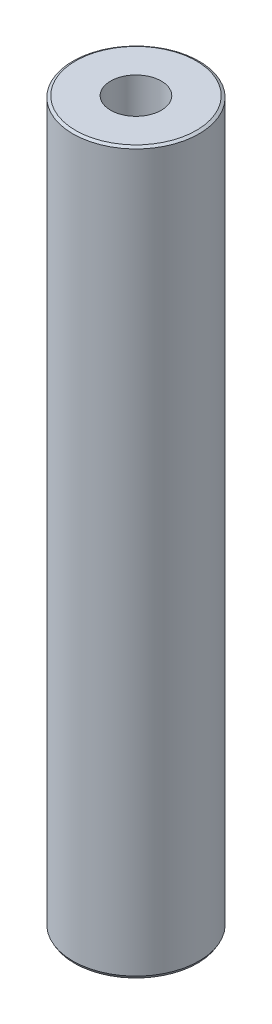
ISO-10303-21;
HEADER;
FILE_DESCRIPTION(('STEP AP214'),'2;1');
FILE_NAME('part.step','',(''),(''),'','','');
FILE_SCHEMA(('AUTOMOTIVE_DESIGN { 1 0 10303 214 1 1 1 1 }'));
ENDSEC;
DATA;
#1=APPLICATION_CONTEXT('core data for automotive mechanical design processes');
#2=APPLICATION_PROTOCOL_DEFINITION('international standard','automotive_design',2000,#1);
#3=PRODUCT_CONTEXT('',#1,'mechanical');
#4=PRODUCT('Part','Part','',(#3));
#5=PRODUCT_RELATED_PRODUCT_CATEGORY('part','',(#4));
#6=PRODUCT_DEFINITION_FORMATION('','',#4);
#7=PRODUCT_DEFINITION_CONTEXT('part definition',#1,'design');
#8=PRODUCT_DEFINITION('design','',#6,#7);
#9=PRODUCT_DEFINITION_SHAPE('','',#8);
#10=(LENGTH_UNIT() NAMED_UNIT(*) SI_UNIT(.MILLI.,.METRE.));
#11=(NAMED_UNIT(*) PLANE_ANGLE_UNIT() SI_UNIT($,.RADIAN.));
#12=(NAMED_UNIT(*) SI_UNIT($,.STERADIAN.) SOLID_ANGLE_UNIT());
#13=UNCERTAINTY_MEASURE_WITH_UNIT(LENGTH_MEASURE(1.E-05),#10,'distance_accuracy_value','');
#14=(GEOMETRIC_REPRESENTATION_CONTEXT(3) GLOBAL_UNCERTAINTY_ASSIGNED_CONTEXT((#13)) GLOBAL_UNIT_ASSIGNED_CONTEXT((#10,
#11,#12)) REPRESENTATION_CONTEXT('',''));
#15=CARTESIAN_POINT('',(0.,0.,0.));
#16=DIRECTION('',(0.,0.,1.));
#17=DIRECTION('',(1.,0.,0.));
#18=AXIS2_PLACEMENT_3D('',#15,#16,#17);
#19=CARTESIAN_POINT('',(0.,600.,0.));
#20=DIRECTION('',(0.,-1.,0.));
#21=DIRECTION('',(0.,0.,-1.));
#22=AXIS2_PLACEMENT_3D('',#19,#20,#21);
#23=CYLINDRICAL_SURFACE('',#22,52.5);
#24=CARTESIAN_POINT('',(0.,598.677713269694,0.));
#25=DIRECTION('',(0.,1.,0.));
#26=DIRECTION('',(0.,0.,1.));
#27=AXIS2_PLACEMENT_3D('',#24,#25,#26);
#28=CIRCLE('',#27,52.5);
#29=CARTESIAN_POINT('',(0.,598.677713269694,52.5));
#30=VERTEX_POINT('',#29);
#31=EDGE_CURVE('E50',#30,#30,#28,.F.);
#32=ORIENTED_EDGE('',*,*,#31,.T.);
#33=EDGE_LOOP('',(#32));
#34=FACE_BOUND('',#33,.T.);
#35=CARTESIAN_POINT('',(0.,2.29026779906394,0.));
#36=DIRECTION('',(0.,1.,0.));
#37=DIRECTION('',(0.,0.,1.));
#38=AXIS2_PLACEMENT_3D('',#35,#36,#37);
#39=CIRCLE('',#38,52.5);
#40=CARTESIAN_POINT('',(0.,2.29026779906394,52.5));
#41=VERTEX_POINT('',#40);
#42=EDGE_CURVE('E51',#41,#41,#39,.T.);
#43=ORIENTED_EDGE('',*,*,#42,.T.);
#44=EDGE_LOOP('',(#43));
#45=FACE_BOUND('',#44,.T.);
#46=ADVANCED_FACE('F39',(#34,#45),#23,.T.);
#47=CARTESIAN_POINT('',(0.,600.,0.));
#48=DIRECTION('',(0.,1.,0.));
#49=DIRECTION('',(0.,0.,1.));
#50=AXIS2_PLACEMENT_3D('',#47,#48,#49);
#51=PLANE('',#50);
#52=CARTESIAN_POINT('',(0.,600.,0.));
#53=DIRECTION('',(0.,1.,0.));
#54=DIRECTION('',(0.,0.,1.));
#55=AXIS2_PLACEMENT_3D('',#52,#53,#54);
#56=CIRCLE('',#55,50.2097322009358);
#57=CARTESIAN_POINT('',(0.,600.,50.2097322009358));
#58=VERTEX_POINT('',#57);
#59=EDGE_CURVE('E54',#58,#58,#56,.T.);
#60=ORIENTED_EDGE('',*,*,#59,.T.);
#61=EDGE_LOOP('',(#60));
#62=FACE_BOUND('',#61,.T.);
#63=CARTESIAN_POINT('',(0.,600.,0.));
#64=DIRECTION('',(0.,1.,0.));
#65=DIRECTION('',(0.,0.,1.));
#66=AXIS2_PLACEMENT_3D('',#63,#64,#65);
#67=CIRCLE('',#66,21.1030131773446);
#68=CARTESIAN_POINT('',(0.,600.,21.1030131773446));
#69=VERTEX_POINT('',#68);
#70=EDGE_CURVE('E58',#69,#69,#67,.T.);
#71=ORIENTED_EDGE('',*,*,#70,.F.);
#72=EDGE_LOOP('',(#71));
#73=FACE_BOUND('',#72,.T.);
#74=ADVANCED_FACE('F69',(#62,#73),#51,.T.);
#75=CARTESIAN_POINT('',(0.,0.,0.));
#76=DIRECTION('',(0.,1.,0.));
#77=DIRECTION('',(0.,0.,1.));
#78=AXIS2_PLACEMENT_3D('',#75,#76,#77);
#79=PLANE('',#78);
#80=CARTESIAN_POINT('',(0.,0.,0.));
#81=DIRECTION('',(0.,1.,0.));
#82=DIRECTION('',(0.,0.,1.));
#83=AXIS2_PLACEMENT_3D('',#80,#81,#82);
#84=CIRCLE('',#83,51.1777132696941);
#85=CARTESIAN_POINT('',(0.,0.,51.1777132696941));
#86=VERTEX_POINT('',#85);
#87=EDGE_CURVE('E10',#86,#86,#84,.F.);
#88=ORIENTED_EDGE('',*,*,#87,.T.);
#89=EDGE_LOOP('',(#88));
#90=FACE_BOUND('',#89,.T.);
#91=CARTESIAN_POINT('',(0.,0.,0.));
#92=DIRECTION('',(0.,1.,0.));
#93=DIRECTION('',(0.,0.,1.));
#94=AXIS2_PLACEMENT_3D('',#91,#92,#93);
#95=CIRCLE('',#94,21.1030131773446);
#96=CARTESIAN_POINT('',(0.,0.,21.1030131773446));
#97=VERTEX_POINT('',#96);
#98=EDGE_CURVE('E63',#97,#97,#95,.T.);
#99=ORIENTED_EDGE('',*,*,#98,.T.);
#100=EDGE_LOOP('',(#99));
#101=FACE_BOUND('',#100,.T.);
#102=ADVANCED_FACE('F75',(#90,#101),#79,.F.);
#103=CARTESIAN_POINT('',(0.,600.,0.));
#104=DIRECTION('',(0.,-1.,0.));
#105=DIRECTION('',(0.,0.,-1.));
#106=AXIS2_PLACEMENT_3D('',#103,#104,#105);
#107=CYLINDRICAL_SURFACE('',#106,21.1030131773446);
#108=ORIENTED_EDGE('',*,*,#70,.T.);
#109=EDGE_LOOP('',(#108));
#110=FACE_BOUND('',#109,.T.);
#111=ORIENTED_EDGE('',*,*,#98,.F.);
#112=EDGE_LOOP('',(#111));
#113=FACE_BOUND('',#112,.T.);
#114=ADVANCED_FACE('F70',(#110,#113),#107,.F.);
#115=CARTESIAN_POINT('',(0.,600.,0.));
#116=DIRECTION('',(0.,-1.,0.));
#117=DIRECTION('',(0.,0.,-1.));
#118=AXIS2_PLACEMENT_3D('',#115,#116,#117);
#119=CONICAL_SURFACE('',#118,50.2097322009358,1.04719755119657);
#120=ORIENTED_EDGE('',*,*,#31,.F.);
#121=EDGE_LOOP('',(#120));
#122=FACE_BOUND('',#121,.T.);
#123=ORIENTED_EDGE('',*,*,#59,.F.);
#124=EDGE_LOOP('',(#123));
#125=FACE_BOUND('',#124,.T.);
#126=ADVANCED_FACE('F81',(#122,#125),#119,.T.);
#127=CARTESIAN_POINT('',(0.,2.29026779906394,0.));
#128=DIRECTION('',(0.,1.,0.));
#129=DIRECTION('',(0.,0.,1.));
#130=AXIS2_PLACEMENT_3D('',#127,#128,#129);
#131=CONICAL_SURFACE('',#130,52.5,0.523598775598313);
#132=ORIENTED_EDGE('',*,*,#87,.F.);
#133=EDGE_LOOP('',(#132));
#134=FACE_BOUND('',#133,.T.);
#135=ORIENTED_EDGE('',*,*,#42,.F.);
#136=EDGE_LOOP('',(#135));
#137=FACE_BOUND('',#136,.T.);
#138=ADVANCED_FACE('F45',(#134,#137),#131,.T.);
#139=CLOSED_SHELL('',(#46,#74,#102,#114,#126,#138));
#140=MANIFOLD_SOLID_BREP('B2',#139);
#141=ADVANCED_BREP_SHAPE_REPRESENTATION('',(#18,#140),#14);
#142=SHAPE_DEFINITION_REPRESENTATION(#9,#141);
ENDSEC;
END-ISO-10303-21;
